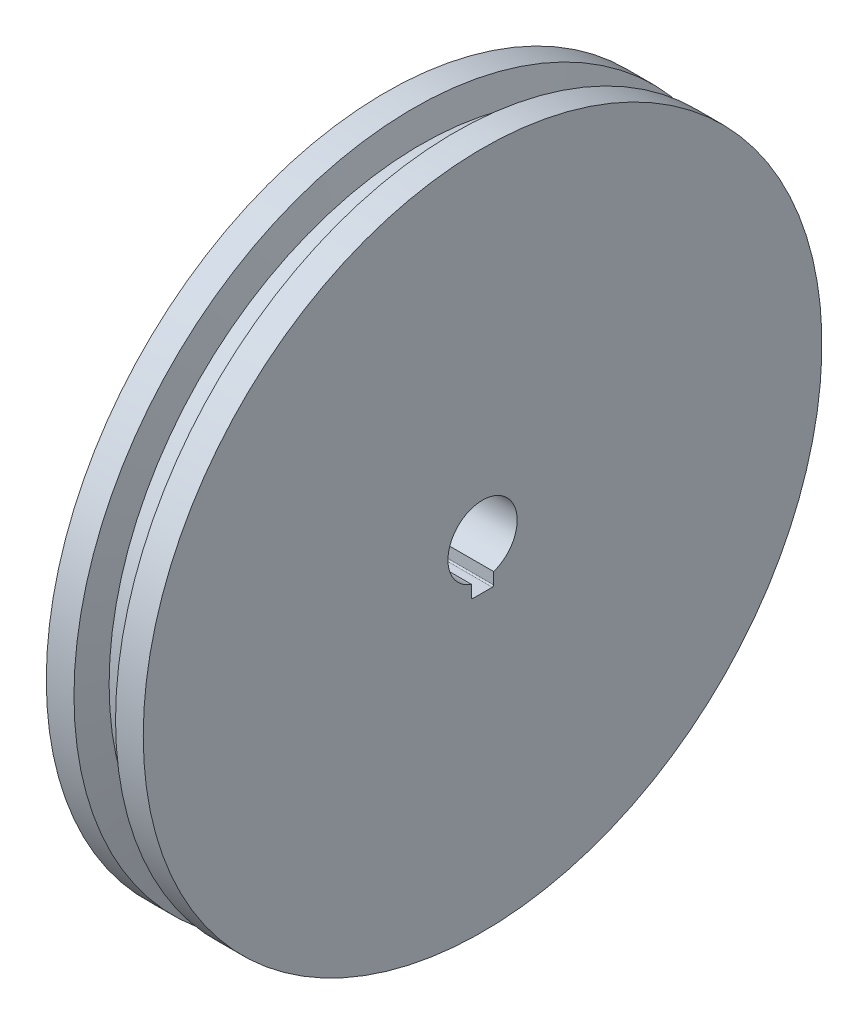
ISO-10303-21;
HEADER;
FILE_DESCRIPTION(('STEP AP214'),'2;1');
FILE_NAME('part.step','',(''),(''),'','','');
FILE_SCHEMA(('AUTOMOTIVE_DESIGN { 1 0 10303 214 1 1 1 1 }'));
ENDSEC;
DATA;
#1=APPLICATION_CONTEXT('core data for automotive mechanical design processes');
#2=APPLICATION_PROTOCOL_DEFINITION('international standard','automotive_design',2000,#1);
#3=PRODUCT_CONTEXT('',#1,'mechanical');
#4=PRODUCT('Part','Part','',(#3));
#5=PRODUCT_RELATED_PRODUCT_CATEGORY('part','',(#4));
#6=PRODUCT_DEFINITION_FORMATION('','',#4);
#7=PRODUCT_DEFINITION_CONTEXT('part definition',#1,'design');
#8=PRODUCT_DEFINITION('design','',#6,#7);
#9=PRODUCT_DEFINITION_SHAPE('','',#8);
#10=(LENGTH_UNIT() NAMED_UNIT(*) SI_UNIT(.MILLI.,.METRE.));
#11=(NAMED_UNIT(*) PLANE_ANGLE_UNIT() SI_UNIT($,.RADIAN.));
#12=(NAMED_UNIT(*) SI_UNIT($,.STERADIAN.) SOLID_ANGLE_UNIT());
#13=UNCERTAINTY_MEASURE_WITH_UNIT(LENGTH_MEASURE(1.E-05),#10,'distance_accuracy_value','');
#14=(GEOMETRIC_REPRESENTATION_CONTEXT(3) GLOBAL_UNCERTAINTY_ASSIGNED_CONTEXT((#13)) GLOBAL_UNIT_ASSIGNED_CONTEXT((#10,
#11,#12)) REPRESENTATION_CONTEXT('',''));
#15=CARTESIAN_POINT('',(0.,0.,0.));
#16=DIRECTION('',(0.,0.,1.));
#17=DIRECTION('',(1.,0.,0.));
#18=AXIS2_PLACEMENT_3D('',#15,#16,#17);
#19=CARTESIAN_POINT('',(57.3205080756888,0.,0.));
#20=DIRECTION('',(1.,0.,0.));
#21=DIRECTION('',(0.,0.,-1.));
#22=AXIS2_PLACEMENT_3D('',#19,#20,#21);
#23=CONICAL_SURFACE('',#22,112.5,1.30899693899575);
#24=CARTESIAN_POINT('',(60.,0.,0.));
#25=DIRECTION('',(-1.,0.,0.));
#26=DIRECTION('',(0.,0.,1.));
#27=AXIS2_PLACEMENT_3D('',#24,#25,#26);
#28=CIRCLE('',#27,122.5);
#29=CARTESIAN_POINT('',(60.,0.,122.5));
#30=VERTEX_POINT('',#29);
#31=EDGE_CURVE('E39',#30,#30,#28,.T.);
#32=ORIENTED_EDGE('',*,*,#31,.T.);
#33=EDGE_LOOP('',(#32));
#34=FACE_BOUND('',#33,.T.);
#35=CARTESIAN_POINT('',(57.3205080756888,0.,0.));
#36=DIRECTION('',(-1.,0.,0.));
#37=DIRECTION('',(0.,0.,1.));
#38=AXIS2_PLACEMENT_3D('',#35,#36,#37);
#39=CIRCLE('',#38,112.5);
#40=CARTESIAN_POINT('',(57.3205080756888,0.,112.5));
#41=VERTEX_POINT('',#40);
#42=EDGE_CURVE('E127',#41,#41,#39,.T.);
#43=ORIENTED_EDGE('',*,*,#42,.F.);
#44=EDGE_LOOP('',(#43));
#45=FACE_BOUND('',#44,.T.);
#46=ADVANCED_FACE('F32',(#34,#45),#23,.T.);
#47=CARTESIAN_POINT('',(0.,0.,0.));
#48=DIRECTION('',(-1.,0.,0.));
#49=DIRECTION('',(0.,0.,1.));
#50=AXIS2_PLACEMENT_3D('',#47,#48,#49);
#51=CYLINDRICAL_SURFACE('',#50,122.5);
#52=CARTESIAN_POINT('',(70.,0.,0.));
#53=DIRECTION('',(-1.,0.,0.));
#54=DIRECTION('',(0.,0.,1.));
#55=AXIS2_PLACEMENT_3D('',#52,#53,#54);
#56=CIRCLE('',#55,122.5);
#57=CARTESIAN_POINT('',(70.,0.,122.5));
#58=VERTEX_POINT('',#57);
#59=EDGE_CURVE('E161',#58,#58,#56,.T.);
#60=ORIENTED_EDGE('',*,*,#59,.T.);
#61=EDGE_LOOP('',(#60));
#62=FACE_BOUND('',#61,.T.);
#63=ORIENTED_EDGE('',*,*,#31,.F.);
#64=EDGE_LOOP('',(#63));
#65=FACE_BOUND('',#64,.T.);
#66=ADVANCED_FACE('F168',(#62,#65),#51,.T.);
#67=CARTESIAN_POINT('',(70.,-122.5,0.));
#68=DIRECTION('',(1.,0.,0.));
#69=DIRECTION('',(0.,0.,-1.));
#70=AXIS2_PLACEMENT_3D('',#67,#68,#69);
#71=PLANE('',#70);
#72=DIRECTION('',(0.,-1.,0.));
#73=VECTOR('',#72,1.);
#74=CARTESIAN_POINT('',(70.,-16.,-4.));
#75=LINE('',#74,#73);
#76=CARTESIAN_POINT('',(70.,-11.842719282327,-4.));
#77=VERTEX_POINT('',#76);
#78=CARTESIAN_POINT('',(70.,-16.,-4.));
#79=VERTEX_POINT('',#78);
#80=EDGE_CURVE('E52',#77,#79,#75,.T.);
#81=ORIENTED_EDGE('',*,*,#80,.T.);
#82=CARTESIAN_POINT('',(70.,-16.,-3.5));
#83=DIRECTION('',(-1.,0.,0.));
#84=DIRECTION('',(0.,0.,-1.));
#85=AXIS2_PLACEMENT_3D('',#82,#83,#84);
#86=CIRCLE('',#85,0.5);
#87=CARTESIAN_POINT('',(70.,-16.5,-3.49999999999999));
#88=VERTEX_POINT('',#87);
#89=EDGE_CURVE('E88',#79,#88,#86,.T.);
#90=ORIENTED_EDGE('',*,*,#89,.T.);
#91=DIRECTION('',(0.,0.,1.));
#92=VECTOR('',#91,1.);
#93=CARTESIAN_POINT('',(70.,-16.5,3.5));
#94=LINE('',#93,#92);
#95=CARTESIAN_POINT('',(70.,-16.5,3.5));
#96=VERTEX_POINT('',#95);
#97=EDGE_CURVE('E93',#88,#96,#94,.T.);
#98=ORIENTED_EDGE('',*,*,#97,.T.);
#99=CARTESIAN_POINT('',(70.,-16.,3.5));
#100=DIRECTION('',(-1.,0.,0.));
#101=DIRECTION('',(0.,0.,1.));
#102=AXIS2_PLACEMENT_3D('',#99,#100,#101);
#103=CIRCLE('',#102,0.5);
#104=CARTESIAN_POINT('',(70.,-16.,4.));
#105=VERTEX_POINT('',#104);
#106=EDGE_CURVE('E107',#96,#105,#103,.T.);
#107=ORIENTED_EDGE('',*,*,#106,.T.);
#108=DIRECTION('',(0.,1.,0.));
#109=VECTOR('',#108,1.);
#110=CARTESIAN_POINT('',(70.,-16.,4.));
#111=LINE('',#110,#109);
#112=CARTESIAN_POINT('',(70.,-11.842719282327,4.));
#113=VERTEX_POINT('',#112);
#114=EDGE_CURVE('E85',#105,#113,#111,.T.);
#115=ORIENTED_EDGE('',*,*,#114,.T.);
#116=CARTESIAN_POINT('',(70.,0.,0.));
#117=DIRECTION('',(-1.,0.,0.));
#118=DIRECTION('',(0.,0.,1.));
#119=AXIS2_PLACEMENT_3D('',#116,#117,#118);
#120=CIRCLE('',#119,12.5);
#121=EDGE_CURVE('E100',#113,#77,#120,.T.);
#122=ORIENTED_EDGE('',*,*,#121,.T.);
#123=EDGE_LOOP('',(#81,#90,#98,#107,#115,#122));
#124=FACE_BOUND('',#123,.T.);
#125=ORIENTED_EDGE('',*,*,#59,.F.);
#126=EDGE_LOOP('',(#125));
#127=FACE_BOUND('',#126,.T.);
#128=ADVANCED_FACE('F96',(#124,#127),#71,.T.);
#129=CARTESIAN_POINT('',(0.,0.,0.));
#130=DIRECTION('',(-1.,0.,0.));
#131=DIRECTION('',(0.,0.,1.));
#132=AXIS2_PLACEMENT_3D('',#129,#130,#131);
#133=CYLINDRICAL_SURFACE('',#132,12.5);
#134=DIRECTION('',(-1.,0.,0.));
#135=VECTOR('',#134,1.);
#136=CARTESIAN_POINT('',(0.,-11.842719282327,-4.));
#137=LINE('',#136,#135);
#138=CARTESIAN_POINT('',(0.,-11.842719282327,-4.));
#139=VERTEX_POINT('',#138);
#140=EDGE_CURVE('E125',#77,#139,#137,.T.);
#141=ORIENTED_EDGE('',*,*,#140,.F.);
#142=ORIENTED_EDGE('',*,*,#121,.F.);
#143=DIRECTION('',(-1.,0.,0.));
#144=VECTOR('',#143,1.);
#145=CARTESIAN_POINT('',(0.,-11.842719282327,4.));
#146=LINE('',#145,#144);
#147=CARTESIAN_POINT('',(0.,-11.842719282327,4.));
#148=VERTEX_POINT('',#147);
#149=EDGE_CURVE('E120',#148,#113,#146,.F.);
#150=ORIENTED_EDGE('',*,*,#149,.F.);
#151=CARTESIAN_POINT('',(0.,0.,0.));
#152=DIRECTION('',(-1.,0.,0.));
#153=DIRECTION('',(0.,0.,1.));
#154=AXIS2_PLACEMENT_3D('',#151,#152,#153);
#155=CIRCLE('',#154,12.5);
#156=EDGE_CURVE('E157',#148,#139,#155,.T.);
#157=ORIENTED_EDGE('',*,*,#156,.T.);
#158=EDGE_LOOP('',(#141,#142,#150,#157));
#159=FACE_BOUND('',#158,.T.);
#160=ADVANCED_FACE('F175',(#159),#133,.F.);
#161=CARTESIAN_POINT('',(0.,-30.,0.));
#162=DIRECTION('',(-1.,0.,0.));
#163=DIRECTION('',(0.,0.,1.));
#164=AXIS2_PLACEMENT_3D('',#161,#162,#163);
#165=PLANE('',#164);
#166=DIRECTION('',(0.,-1.,0.));
#167=VECTOR('',#166,1.);
#168=CARTESIAN_POINT('',(0.,-30.,-4.));
#169=LINE('',#168,#167);
#170=CARTESIAN_POINT('',(0.,-16.,-4.));
#171=VERTEX_POINT('',#170);
#172=EDGE_CURVE('E11',#139,#171,#169,.T.);
#173=ORIENTED_EDGE('',*,*,#172,.F.);
#174=ORIENTED_EDGE('',*,*,#156,.F.);
#175=DIRECTION('',(0.,1.,0.));
#176=VECTOR('',#175,1.);
#177=CARTESIAN_POINT('',(0.,-16.,4.));
#178=LINE('',#177,#176);
#179=CARTESIAN_POINT('',(0.,-16.,4.));
#180=VERTEX_POINT('',#179);
#181=EDGE_CURVE('E101',#180,#148,#178,.T.);
#182=ORIENTED_EDGE('',*,*,#181,.F.);
#183=CARTESIAN_POINT('',(0.,-16.,3.5));
#184=DIRECTION('',(-1.,0.,0.));
#185=DIRECTION('',(0.,0.,1.));
#186=AXIS2_PLACEMENT_3D('',#183,#184,#185);
#187=CIRCLE('',#186,0.5);
#188=CARTESIAN_POINT('',(0.,-16.5,3.5));
#189=VERTEX_POINT('',#188);
#190=EDGE_CURVE('E103',#189,#180,#187,.T.);
#191=ORIENTED_EDGE('',*,*,#190,.F.);
#192=DIRECTION('',(0.,0.,1.));
#193=VECTOR('',#192,1.);
#194=CARTESIAN_POINT('',(0.,-16.5,3.5));
#195=LINE('',#194,#193);
#196=CARTESIAN_POINT('',(0.,-16.5,-3.49999999999999));
#197=VERTEX_POINT('',#196);
#198=EDGE_CURVE('E113',#197,#189,#195,.T.);
#199=ORIENTED_EDGE('',*,*,#198,.F.);
#200=CARTESIAN_POINT('',(0.,-16.,-3.5));
#201=DIRECTION('',(-1.,0.,0.));
#202=DIRECTION('',(0.,0.,-1.));
#203=AXIS2_PLACEMENT_3D('',#200,#201,#202);
#204=CIRCLE('',#203,0.5);
#205=EDGE_CURVE('E111',#171,#197,#204,.T.);
#206=ORIENTED_EDGE('',*,*,#205,.F.);
#207=EDGE_LOOP('',(#173,#174,#182,#191,#199,#206));
#208=FACE_BOUND('',#207,.T.);
#209=CARTESIAN_POINT('',(0.,0.,0.));
#210=DIRECTION('',(-1.,0.,0.));
#211=DIRECTION('',(0.,0.,1.));
#212=AXIS2_PLACEMENT_3D('',#209,#210,#211);
#213=CIRCLE('',#212,30.);
#214=CARTESIAN_POINT('',(0.,0.,30.));
#215=VERTEX_POINT('',#214);
#216=EDGE_CURVE('E154',#215,#215,#213,.T.);
#217=ORIENTED_EDGE('',*,*,#216,.T.);
#218=EDGE_LOOP('',(#217));
#219=FACE_BOUND('',#218,.T.);
#220=ADVANCED_FACE('F180',(#208,#219),#165,.T.);
#221=CARTESIAN_POINT('',(0.,0.,0.));
#222=DIRECTION('',(-1.,0.,0.));
#223=DIRECTION('',(0.,0.,1.));
#224=AXIS2_PLACEMENT_3D('',#221,#222,#223);
#225=CYLINDRICAL_SURFACE('',#224,30.);
#226=CARTESIAN_POINT('',(10.,0.,0.));
#227=DIRECTION('',(-1.,0.,0.));
#228=DIRECTION('',(0.,0.,1.));
#229=AXIS2_PLACEMENT_3D('',#226,#227,#228);
#230=CIRCLE('',#229,30.);
#231=CARTESIAN_POINT('',(10.,0.,30.));
#232=VERTEX_POINT('',#231);
#233=EDGE_CURVE('E151',#232,#232,#230,.T.);
#234=ORIENTED_EDGE('',*,*,#233,.T.);
#235=EDGE_LOOP('',(#234));
#236=FACE_BOUND('',#235,.T.);
#237=ORIENTED_EDGE('',*,*,#216,.F.);
#238=EDGE_LOOP('',(#237));
#239=FACE_BOUND('',#238,.T.);
#240=ADVANCED_FACE('F184',(#236,#239),#225,.T.);
#241=CARTESIAN_POINT('',(10.,0.,0.));
#242=DIRECTION('',(-1.,0.,0.));
#243=DIRECTION('',(0.,0.,1.));
#244=AXIS2_PLACEMENT_3D('',#241,#242,#243);
#245=CONICAL_SURFACE('',#244,30.,1.30899693899575);
#246=CARTESIAN_POINT('',(12.6794919243112,0.,0.));
#247=DIRECTION('',(-1.,0.,0.));
#248=DIRECTION('',(0.,0.,1.));
#249=AXIS2_PLACEMENT_3D('',#246,#247,#248);
#250=CIRCLE('',#249,20.);
#251=CARTESIAN_POINT('',(12.6794919243112,0.,20.));
#252=VERTEX_POINT('',#251);
#253=EDGE_CURVE('E148',#252,#252,#250,.T.);
#254=ORIENTED_EDGE('',*,*,#253,.T.);
#255=EDGE_LOOP('',(#254));
#256=FACE_BOUND('',#255,.T.);
#257=ORIENTED_EDGE('',*,*,#233,.F.);
#258=EDGE_LOOP('',(#257));
#259=FACE_BOUND('',#258,.T.);
#260=ADVANCED_FACE('F188',(#256,#259),#245,.T.);
#261=CARTESIAN_POINT('',(0.,0.,0.));
#262=DIRECTION('',(-1.,0.,0.));
#263=DIRECTION('',(0.,0.,1.));
#264=AXIS2_PLACEMENT_3D('',#261,#262,#263);
#265=CYLINDRICAL_SURFACE('',#264,20.);
#266=CARTESIAN_POINT('',(22.3205080756888,0.,0.));
#267=DIRECTION('',(-1.,0.,0.));
#268=DIRECTION('',(0.,0.,1.));
#269=AXIS2_PLACEMENT_3D('',#266,#267,#268);
#270=CIRCLE('',#269,20.);
#271=CARTESIAN_POINT('',(22.3205080756888,0.,20.));
#272=VERTEX_POINT('',#271);
#273=EDGE_CURVE('E145',#272,#272,#270,.T.);
#274=ORIENTED_EDGE('',*,*,#273,.T.);
#275=EDGE_LOOP('',(#274));
#276=FACE_BOUND('',#275,.T.);
#277=ORIENTED_EDGE('',*,*,#253,.F.);
#278=EDGE_LOOP('',(#277));
#279=FACE_BOUND('',#278,.T.);
#280=ADVANCED_FACE('F192',(#276,#279),#265,.T.);
#281=CARTESIAN_POINT('',(22.3205080756888,0.,0.));
#282=DIRECTION('',(1.,0.,0.));
#283=DIRECTION('',(0.,0.,-1.));
#284=AXIS2_PLACEMENT_3D('',#281,#282,#283);
#285=CONICAL_SURFACE('',#284,20.,1.30899693899575);
#286=CARTESIAN_POINT('',(25.,0.,0.));
#287=DIRECTION('',(-1.,0.,0.));
#288=DIRECTION('',(0.,0.,1.));
#289=AXIS2_PLACEMENT_3D('',#286,#287,#288);
#290=CIRCLE('',#289,30.);
#291=CARTESIAN_POINT('',(25.,0.,30.));
#292=VERTEX_POINT('',#291);
#293=EDGE_CURVE('E142',#292,#292,#290,.T.);
#294=ORIENTED_EDGE('',*,*,#293,.T.);
#295=EDGE_LOOP('',(#294));
#296=FACE_BOUND('',#295,.T.);
#297=ORIENTED_EDGE('',*,*,#273,.F.);
#298=EDGE_LOOP('',(#297));
#299=FACE_BOUND('',#298,.T.);
#300=ADVANCED_FACE('F196',(#296,#299),#285,.T.);
#301=CARTESIAN_POINT('',(0.,0.,0.));
#302=DIRECTION('',(-1.,0.,0.));
#303=DIRECTION('',(0.,0.,1.));
#304=AXIS2_PLACEMENT_3D('',#301,#302,#303);
#305=CYLINDRICAL_SURFACE('',#304,30.);
#306=CARTESIAN_POINT('',(35.,0.,0.));
#307=DIRECTION('',(-1.,0.,0.));
#308=DIRECTION('',(0.,0.,1.));
#309=AXIS2_PLACEMENT_3D('',#306,#307,#308);
#310=CIRCLE('',#309,30.);
#311=CARTESIAN_POINT('',(35.,0.,30.));
#312=VERTEX_POINT('',#311);
#313=EDGE_CURVE('E139',#312,#312,#310,.T.);
#314=ORIENTED_EDGE('',*,*,#313,.T.);
#315=EDGE_LOOP('',(#314));
#316=FACE_BOUND('',#315,.T.);
#317=ORIENTED_EDGE('',*,*,#293,.F.);
#318=EDGE_LOOP('',(#317));
#319=FACE_BOUND('',#318,.T.);
#320=ADVANCED_FACE('F200',(#316,#319),#305,.T.);
#321=CARTESIAN_POINT('',(35.,-30.,0.));
#322=DIRECTION('',(-1.,0.,0.));
#323=DIRECTION('',(0.,0.,1.));
#324=AXIS2_PLACEMENT_3D('',#321,#322,#323);
#325=PLANE('',#324);
#326=CARTESIAN_POINT('',(35.,0.,0.));
#327=DIRECTION('',(-1.,0.,0.));
#328=DIRECTION('',(0.,0.,1.));
#329=AXIS2_PLACEMENT_3D('',#326,#327,#328);
#330=CIRCLE('',#329,122.5);
#331=CARTESIAN_POINT('',(35.,0.,122.5));
#332=VERTEX_POINT('',#331);
#333=EDGE_CURVE('E136',#332,#332,#330,.T.);
#334=ORIENTED_EDGE('',*,*,#333,.T.);
#335=EDGE_LOOP('',(#334));
#336=FACE_BOUND('',#335,.T.);
#337=ORIENTED_EDGE('',*,*,#313,.F.);
#338=EDGE_LOOP('',(#337));
#339=FACE_BOUND('',#338,.T.);
#340=ADVANCED_FACE('F204',(#336,#339),#325,.T.);
#341=CARTESIAN_POINT('',(0.,0.,0.));
#342=DIRECTION('',(-1.,0.,0.));
#343=DIRECTION('',(0.,0.,1.));
#344=AXIS2_PLACEMENT_3D('',#341,#342,#343);
#345=CYLINDRICAL_SURFACE('',#344,122.5);
#346=CARTESIAN_POINT('',(45.,0.,0.));
#347=DIRECTION('',(-1.,0.,0.));
#348=DIRECTION('',(0.,0.,1.));
#349=AXIS2_PLACEMENT_3D('',#346,#347,#348);
#350=CIRCLE('',#349,122.5);
#351=CARTESIAN_POINT('',(45.,0.,122.5));
#352=VERTEX_POINT('',#351);
#353=EDGE_CURVE('E133',#352,#352,#350,.T.);
#354=ORIENTED_EDGE('',*,*,#353,.T.);
#355=EDGE_LOOP('',(#354));
#356=FACE_BOUND('',#355,.T.);
#357=ORIENTED_EDGE('',*,*,#333,.F.);
#358=EDGE_LOOP('',(#357));
#359=FACE_BOUND('',#358,.T.);
#360=ADVANCED_FACE('F208',(#356,#359),#345,.T.);
#361=CARTESIAN_POINT('',(45.,0.,0.));
#362=DIRECTION('',(-1.,0.,0.));
#363=DIRECTION('',(0.,0.,1.));
#364=AXIS2_PLACEMENT_3D('',#361,#362,#363);
#365=CONICAL_SURFACE('',#364,122.5,1.30899693899575);
#366=CARTESIAN_POINT('',(47.6794919243112,0.,0.));
#367=DIRECTION('',(-1.,0.,0.));
#368=DIRECTION('',(0.,0.,1.));
#369=AXIS2_PLACEMENT_3D('',#366,#367,#368);
#370=CIRCLE('',#369,112.5);
#371=CARTESIAN_POINT('',(47.6794919243112,0.,112.5));
#372=VERTEX_POINT('',#371);
#373=EDGE_CURVE('E130',#372,#372,#370,.T.);
#374=ORIENTED_EDGE('',*,*,#373,.T.);
#375=EDGE_LOOP('',(#374));
#376=FACE_BOUND('',#375,.T.);
#377=ORIENTED_EDGE('',*,*,#353,.F.);
#378=EDGE_LOOP('',(#377));
#379=FACE_BOUND('',#378,.T.);
#380=ADVANCED_FACE('F212',(#376,#379),#365,.T.);
#381=CARTESIAN_POINT('',(0.,0.,0.));
#382=DIRECTION('',(-1.,0.,0.));
#383=DIRECTION('',(0.,0.,1.));
#384=AXIS2_PLACEMENT_3D('',#381,#382,#383);
#385=CYLINDRICAL_SURFACE('',#384,112.5);
#386=ORIENTED_EDGE('',*,*,#42,.T.);
#387=EDGE_LOOP('',(#386));
#388=FACE_BOUND('',#387,.T.);
#389=ORIENTED_EDGE('',*,*,#373,.F.);
#390=EDGE_LOOP('',(#389));
#391=FACE_BOUND('',#390,.T.);
#392=ADVANCED_FACE('F216',(#388,#391),#385,.T.);
#393=CARTESIAN_POINT('',(70.,-16.,-4.));
#394=DIRECTION('',(0.,0.,-1.));
#395=DIRECTION('',(-1.,0.,0.));
#396=AXIS2_PLACEMENT_3D('',#393,#394,#395);
#397=PLANE('',#396);
#398=ORIENTED_EDGE('',*,*,#140,.T.);
#399=ORIENTED_EDGE('',*,*,#172,.T.);
#400=DIRECTION('',(-1.,0.,0.));
#401=VECTOR('',#400,1.);
#402=CARTESIAN_POINT('',(70.,-16.,-4.));
#403=LINE('',#402,#401);
#404=EDGE_CURVE('E46',#79,#171,#403,.T.);
#405=ORIENTED_EDGE('',*,*,#404,.F.);
#406=ORIENTED_EDGE('',*,*,#80,.F.);
#407=EDGE_LOOP('',(#398,#399,#405,#406));
#408=FACE_BOUND('',#407,.T.);
#409=ADVANCED_FACE('F81',(#408),#397,.F.);
#410=CARTESIAN_POINT('',(70.,-16.,4.));
#411=DIRECTION('',(0.,0.,1.));
#412=DIRECTION('',(1.,0.,0.));
#413=AXIS2_PLACEMENT_3D('',#410,#411,#412);
#414=PLANE('',#413);
#415=ORIENTED_EDGE('',*,*,#149,.T.);
#416=ORIENTED_EDGE('',*,*,#114,.F.);
#417=DIRECTION('',(-1.,0.,0.));
#418=VECTOR('',#417,1.);
#419=CARTESIAN_POINT('',(70.,-16.,4.));
#420=LINE('',#419,#418);
#421=EDGE_CURVE('E118',#105,#180,#420,.T.);
#422=ORIENTED_EDGE('',*,*,#421,.T.);
#423=ORIENTED_EDGE('',*,*,#181,.T.);
#424=EDGE_LOOP('',(#415,#416,#422,#423));
#425=FACE_BOUND('',#424,.T.);
#426=ADVANCED_FACE('F223',(#425),#414,.F.);
#427=CARTESIAN_POINT('',(70.,-16.,3.5));
#428=DIRECTION('',(-1.,0.,0.));
#429=DIRECTION('',(0.,0.,1.));
#430=AXIS2_PLACEMENT_3D('',#427,#428,#429);
#431=CYLINDRICAL_SURFACE('',#430,0.5);
#432=ORIENTED_EDGE('',*,*,#190,.T.);
#433=ORIENTED_EDGE('',*,*,#421,.F.);
#434=ORIENTED_EDGE('',*,*,#106,.F.);
#435=DIRECTION('',(-1.,0.,0.));
#436=VECTOR('',#435,1.);
#437=CARTESIAN_POINT('',(70.,-16.5,3.5));
#438=LINE('',#437,#436);
#439=EDGE_CURVE('E121',#96,#189,#438,.T.);
#440=ORIENTED_EDGE('',*,*,#439,.T.);
#441=EDGE_LOOP('',(#432,#433,#434,#440));
#442=FACE_BOUND('',#441,.T.);
#443=ADVANCED_FACE('F229',(#442),#431,.F.);
#444=CARTESIAN_POINT('',(70.,-16.5,3.5));
#445=DIRECTION('',(0.,-1.,0.));
#446=DIRECTION('',(0.,0.,-1.));
#447=AXIS2_PLACEMENT_3D('',#444,#445,#446);
#448=PLANE('',#447);
#449=ORIENTED_EDGE('',*,*,#198,.T.);
#450=ORIENTED_EDGE('',*,*,#439,.F.);
#451=ORIENTED_EDGE('',*,*,#97,.F.);
#452=DIRECTION('',(-1.,0.,0.));
#453=VECTOR('',#452,1.);
#454=CARTESIAN_POINT('',(70.,-16.5,-3.49999999999999));
#455=LINE('',#454,#453);
#456=EDGE_CURVE('E84',#88,#197,#455,.T.);
#457=ORIENTED_EDGE('',*,*,#456,.T.);
#458=EDGE_LOOP('',(#449,#450,#451,#457));
#459=FACE_BOUND('',#458,.T.);
#460=ADVANCED_FACE('F226',(#459),#448,.F.);
#461=CARTESIAN_POINT('',(70.,-16.,-3.5));
#462=DIRECTION('',(-1.,0.,0.));
#463=DIRECTION('',(0.,0.,1.));
#464=AXIS2_PLACEMENT_3D('',#461,#462,#463);
#465=CYLINDRICAL_SURFACE('',#464,0.5);
#466=ORIENTED_EDGE('',*,*,#205,.T.);
#467=ORIENTED_EDGE('',*,*,#456,.F.);
#468=ORIENTED_EDGE('',*,*,#89,.F.);
#469=ORIENTED_EDGE('',*,*,#404,.T.);
#470=EDGE_LOOP('',(#466,#467,#468,#469));
#471=FACE_BOUND('',#470,.T.);
#472=ADVANCED_FACE('F89',(#471),#465,.F.);
#473=CLOSED_SHELL('',(#46,#66,#128,#160,#220,#240,#260,#280,#300,#320,#340,#360,#380,#392,#409,
#426,#443,#460,#472));
#474=MANIFOLD_SOLID_BREP('B2',#473);
#475=ADVANCED_BREP_SHAPE_REPRESENTATION('',(#18,#474),#14);
#476=SHAPE_DEFINITION_REPRESENTATION(#9,#475);
ENDSEC;
END-ISO-10303-21;
